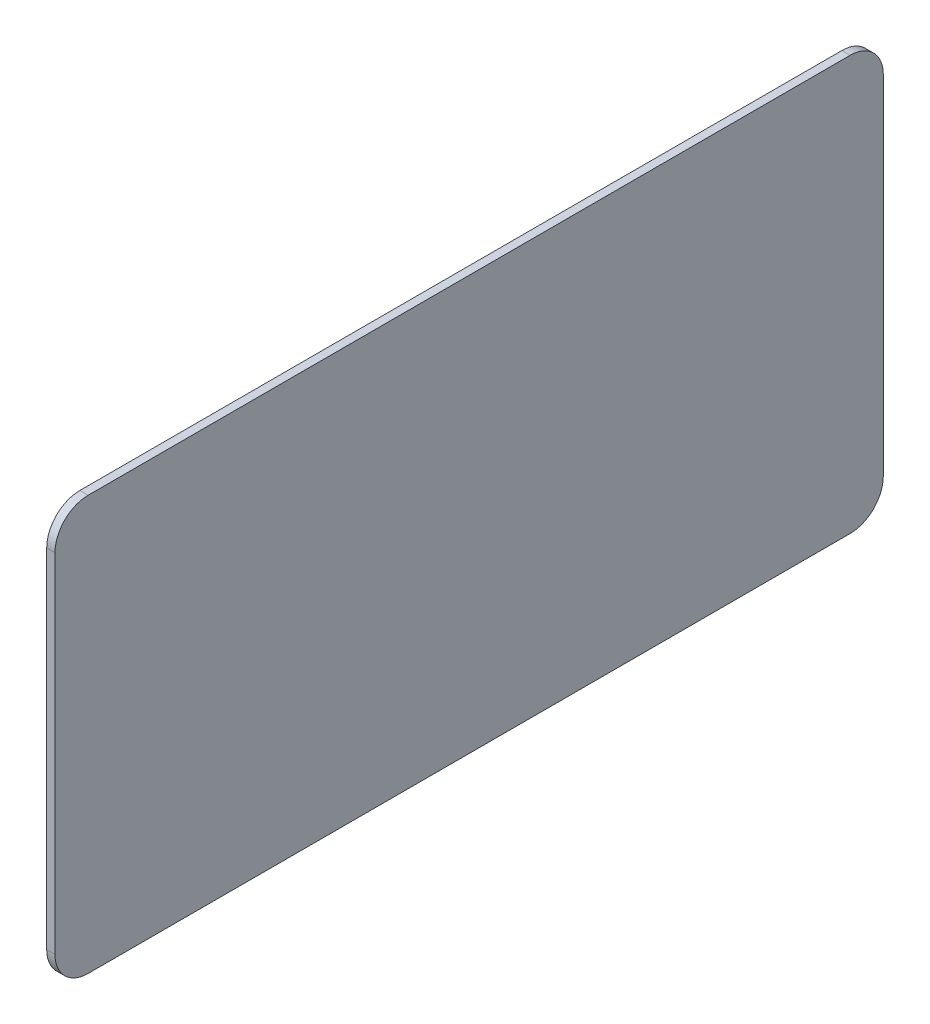
ISO-10303-21;
HEADER;
FILE_DESCRIPTION(('STEP AP214'),'2;1');
FILE_NAME('part.step','',(''),(''),'','','');
FILE_SCHEMA(('AUTOMOTIVE_DESIGN { 1 0 10303 214 1 1 1 1 }'));
ENDSEC;
DATA;
#1=APPLICATION_CONTEXT('core data for automotive mechanical design processes');
#2=APPLICATION_PROTOCOL_DEFINITION('international standard','automotive_design',2000,#1);
#3=PRODUCT_CONTEXT('',#1,'mechanical');
#4=PRODUCT('Part','Part','',(#3));
#5=PRODUCT_RELATED_PRODUCT_CATEGORY('part','',(#4));
#6=PRODUCT_DEFINITION_FORMATION('','',#4);
#7=PRODUCT_DEFINITION_CONTEXT('part definition',#1,'design');
#8=PRODUCT_DEFINITION('design','',#6,#7);
#9=PRODUCT_DEFINITION_SHAPE('','',#8);
#10=(LENGTH_UNIT() NAMED_UNIT(*) SI_UNIT(.MILLI.,.METRE.));
#11=(NAMED_UNIT(*) PLANE_ANGLE_UNIT() SI_UNIT($,.RADIAN.));
#12=(NAMED_UNIT(*) SI_UNIT($,.STERADIAN.) SOLID_ANGLE_UNIT());
#13=UNCERTAINTY_MEASURE_WITH_UNIT(LENGTH_MEASURE(1.E-05),#10,'distance_accuracy_value','');
#14=(GEOMETRIC_REPRESENTATION_CONTEXT(3) GLOBAL_UNCERTAINTY_ASSIGNED_CONTEXT((#13)) GLOBAL_UNIT_ASSIGNED_CONTEXT((#10,
#11,#12)) REPRESENTATION_CONTEXT('',''));
#15=CARTESIAN_POINT('',(0.,0.,0.));
#16=DIRECTION('',(0.,0.,1.));
#17=DIRECTION('',(1.,0.,0.));
#18=AXIS2_PLACEMENT_3D('',#15,#16,#17);
#19=CARTESIAN_POINT('',(15.001,-114.964876976092,25.));
#20=DIRECTION('',(0.,0.,1.));
#21=DIRECTION('',(0.,1.,0.));
#22=AXIS2_PLACEMENT_3D('',#19,#20,#21);
#23=PLANE('',#22);
#24=DIRECTION('',(0.,1.,0.));
#25=VECTOR('',#24,1.);
#26=CARTESIAN_POINT('',(14.5,-104.463876976092,25.));
#27=LINE('',#26,#25);
#28=CARTESIAN_POINT('',(14.5,-114.963876976092,25.));
#29=VERTEX_POINT('',#28);
#30=CARTESIAN_POINT('',(14.5,-93.963876976092,25.));
#31=VERTEX_POINT('',#30);
#32=EDGE_CURVE('E134',#29,#31,#27,.T.);
#33=ORIENTED_EDGE('',*,*,#32,.F.);
#34=DIRECTION('',(-1.,0.,0.));
#35=VECTOR('',#34,1.);
#36=CARTESIAN_POINT('',(14.75,-114.963876976092,25.));
#37=LINE('',#36,#35);
#38=CARTESIAN_POINT('',(15.,-114.963876976092,25.));
#39=VERTEX_POINT('',#38);
#40=EDGE_CURVE('E126',#39,#29,#37,.T.);
#41=ORIENTED_EDGE('',*,*,#40,.F.);
#42=DIRECTION('',(0.,-1.,0.));
#43=VECTOR('',#42,1.);
#44=CARTESIAN_POINT('',(15.,-104.463876976092,25.));
#45=LINE('',#44,#43);
#46=CARTESIAN_POINT('',(15.,-93.963876976092,25.));
#47=VERTEX_POINT('',#46);
#48=EDGE_CURVE('E109',#47,#39,#45,.T.);
#49=ORIENTED_EDGE('',*,*,#48,.F.);
#50=DIRECTION('',(1.,0.,0.));
#51=VECTOR('',#50,1.);
#52=CARTESIAN_POINT('',(14.75,-93.963876976092,25.));
#53=LINE('',#52,#51);
#54=EDGE_CURVE('E102',#31,#47,#53,.T.);
#55=ORIENTED_EDGE('',*,*,#54,.F.);
#56=EDGE_LOOP('',(#33,#41,#49,#55));
#57=FACE_BOUND('',#56,.T.);
#58=ADVANCED_FACE('F17',(#57),#23,.T.);
#59=CARTESIAN_POINT('',(14.5,-93.963876976092,23.));
#60=DIRECTION('',(1.,0.,0.));
#61=DIRECTION('',(0.,0.,-1.));
#62=AXIS2_PLACEMENT_3D('',#59,#60,#61);
#63=CYLINDRICAL_SURFACE('',#62,1.99999999999999);
#64=CARTESIAN_POINT('',(14.5,-93.963876976092,23.));
#65=DIRECTION('',(-1.,0.,0.));
#66=DIRECTION('',(0.,0.,1.));
#67=AXIS2_PLACEMENT_3D('',#64,#65,#66);
#68=CIRCLE('',#67,1.99999999999999);
#69=CARTESIAN_POINT('',(14.5,-91.963876976092,23.));
#70=VERTEX_POINT('',#69);
#71=EDGE_CURVE('E135',#31,#70,#68,.T.);
#72=ORIENTED_EDGE('',*,*,#71,.F.);
#73=ORIENTED_EDGE('',*,*,#54,.T.);
#74=CARTESIAN_POINT('',(15.,-93.963876976092,23.));
#75=DIRECTION('',(1.,0.,0.));
#76=DIRECTION('',(0.,0.,-1.));
#77=AXIS2_PLACEMENT_3D('',#74,#75,#76);
#78=CIRCLE('',#77,1.99999999999999);
#79=CARTESIAN_POINT('',(15.,-91.963876976092,23.));
#80=VERTEX_POINT('',#79);
#81=EDGE_CURVE('E105',#80,#47,#78,.T.);
#82=ORIENTED_EDGE('',*,*,#81,.F.);
#83=DIRECTION('',(1.,0.,0.));
#84=VECTOR('',#83,1.);
#85=CARTESIAN_POINT('',(14.75,-91.963876976092,23.));
#86=LINE('',#85,#84);
#87=EDGE_CURVE('E91',#70,#80,#86,.T.);
#88=ORIENTED_EDGE('',*,*,#87,.F.);
#89=EDGE_LOOP('',(#72,#73,#82,#88));
#90=FACE_BOUND('',#89,.T.);
#91=ADVANCED_FACE('F106',(#90),#63,.T.);
#92=CARTESIAN_POINT('',(15.001,-91.963876976092,23.001));
#93=DIRECTION('',(0.,1.,0.));
#94=DIRECTION('',(0.,0.,-1.));
#95=AXIS2_PLACEMENT_3D('',#92,#93,#94);
#96=PLANE('',#95);
#97=DIRECTION('',(0.,0.,-1.));
#98=VECTOR('',#97,1.);
#99=CARTESIAN_POINT('',(14.5,-91.963876976092,0.));
#100=LINE('',#99,#98);
#101=CARTESIAN_POINT('',(14.5,-91.963876976092,-23.));
#102=VERTEX_POINT('',#101);
#103=EDGE_CURVE('E98',#70,#102,#100,.T.);
#104=ORIENTED_EDGE('',*,*,#103,.F.);
#105=ORIENTED_EDGE('',*,*,#87,.T.);
#106=DIRECTION('',(0.,0.,1.));
#107=VECTOR('',#106,1.);
#108=CARTESIAN_POINT('',(15.,-91.963876976092,0.));
#109=LINE('',#108,#107);
#110=CARTESIAN_POINT('',(15.,-91.963876976092,-23.));
#111=VERTEX_POINT('',#110);
#112=EDGE_CURVE('E95',#111,#80,#109,.T.);
#113=ORIENTED_EDGE('',*,*,#112,.F.);
#114=DIRECTION('',(1.,0.,0.));
#115=VECTOR('',#114,1.);
#116=CARTESIAN_POINT('',(14.75,-91.963876976092,-23.));
#117=LINE('',#116,#115);
#118=EDGE_CURVE('E67',#102,#111,#117,.T.);
#119=ORIENTED_EDGE('',*,*,#118,.F.);
#120=EDGE_LOOP('',(#104,#105,#113,#119));
#121=FACE_BOUND('',#120,.T.);
#122=ADVANCED_FACE('F93',(#121),#96,.T.);
#123=CARTESIAN_POINT('',(14.5,-93.963876976092,-23.));
#124=DIRECTION('',(1.,0.,0.));
#125=DIRECTION('',(0.,0.,-1.));
#126=AXIS2_PLACEMENT_3D('',#123,#124,#125);
#127=CYLINDRICAL_SURFACE('',#126,1.99999999999999);
#128=CARTESIAN_POINT('',(14.5,-93.963876976092,-23.));
#129=DIRECTION('',(-1.,0.,0.));
#130=DIRECTION('',(0.,0.,1.));
#131=AXIS2_PLACEMENT_3D('',#128,#129,#130);
#132=CIRCLE('',#131,1.99999999999999);
#133=CARTESIAN_POINT('',(14.5,-93.963876976092,-25.));
#134=VERTEX_POINT('',#133);
#135=EDGE_CURVE('E137',#102,#134,#132,.T.);
#136=ORIENTED_EDGE('',*,*,#135,.F.);
#137=ORIENTED_EDGE('',*,*,#118,.T.);
#138=CARTESIAN_POINT('',(15.,-93.963876976092,-23.));
#139=DIRECTION('',(1.,0.,0.));
#140=DIRECTION('',(0.,0.,-1.));
#141=AXIS2_PLACEMENT_3D('',#138,#139,#140);
#142=CIRCLE('',#141,1.99999999999999);
#143=CARTESIAN_POINT('',(15.,-93.963876976092,-25.));
#144=VERTEX_POINT('',#143);
#145=EDGE_CURVE('E112',#144,#111,#142,.T.);
#146=ORIENTED_EDGE('',*,*,#145,.F.);
#147=DIRECTION('',(1.,0.,0.));
#148=VECTOR('',#147,1.);
#149=CARTESIAN_POINT('',(14.75,-93.963876976092,-25.));
#150=LINE('',#149,#148);
#151=EDGE_CURVE('E59',#134,#144,#150,.T.);
#152=ORIENTED_EDGE('',*,*,#151,.F.);
#153=EDGE_LOOP('',(#136,#137,#146,#152));
#154=FACE_BOUND('',#153,.T.);
#155=ADVANCED_FACE('F213',(#154),#127,.T.);
#156=CARTESIAN_POINT('',(15.001,-93.962876976092,-25.));
#157=DIRECTION('',(0.,0.,-1.));
#158=DIRECTION('',(0.,-1.,0.));
#159=AXIS2_PLACEMENT_3D('',#156,#157,#158);
#160=PLANE('',#159);
#161=DIRECTION('',(0.,-1.,0.));
#162=VECTOR('',#161,1.);
#163=CARTESIAN_POINT('',(14.5,-104.463876976092,-25.));
#164=LINE('',#163,#162);
#165=CARTESIAN_POINT('',(14.5,-114.963876976092,-25.));
#166=VERTEX_POINT('',#165);
#167=EDGE_CURVE('E139',#134,#166,#164,.T.);
#168=ORIENTED_EDGE('',*,*,#167,.F.);
#169=ORIENTED_EDGE('',*,*,#151,.T.);
#170=DIRECTION('',(0.,1.,0.));
#171=VECTOR('',#170,1.);
#172=CARTESIAN_POINT('',(15.,-104.463876976092,-25.));
#173=LINE('',#172,#171);
#174=CARTESIAN_POINT('',(15.,-114.963876976092,-25.));
#175=VERTEX_POINT('',#174);
#176=EDGE_CURVE('E52',#175,#144,#173,.T.);
#177=ORIENTED_EDGE('',*,*,#176,.F.);
#178=DIRECTION('',(1.,0.,0.));
#179=VECTOR('',#178,1.);
#180=CARTESIAN_POINT('',(14.75,-114.963876976092,-25.));
#181=LINE('',#180,#179);
#182=EDGE_CURVE('E119',#166,#175,#181,.T.);
#183=ORIENTED_EDGE('',*,*,#182,.F.);
#184=EDGE_LOOP('',(#168,#169,#177,#183));
#185=FACE_BOUND('',#184,.T.);
#186=ADVANCED_FACE('F203',(#185),#160,.T.);
#187=CARTESIAN_POINT('',(15.,-91.962876976092,25.001));
#188=DIRECTION('',(1.,0.,0.));
#189=DIRECTION('',(0.,-1.,0.));
#190=AXIS2_PLACEMENT_3D('',#187,#188,#189);
#191=PLANE('',#190);
#192=ORIENTED_EDGE('',*,*,#81,.T.);
#193=ORIENTED_EDGE('',*,*,#48,.T.);
#194=CARTESIAN_POINT('',(15.,-114.963876976092,23.));
#195=DIRECTION('',(1.,0.,0.));
#196=DIRECTION('',(0.,0.,-1.));
#197=AXIS2_PLACEMENT_3D('',#194,#195,#196);
#198=CIRCLE('',#197,2.);
#199=CARTESIAN_POINT('',(15.,-116.963876976092,23.));
#200=VERTEX_POINT('',#199);
#201=EDGE_CURVE('E128',#200,#39,#198,.F.);
#202=ORIENTED_EDGE('',*,*,#201,.F.);
#203=DIRECTION('',(0.,0.,1.));
#204=VECTOR('',#203,1.);
#205=CARTESIAN_POINT('',(15.,-116.963876976092,0.));
#206=LINE('',#205,#204);
#207=CARTESIAN_POINT('',(15.,-116.963876976092,-23.));
#208=VERTEX_POINT('',#207);
#209=EDGE_CURVE('E122',#208,#200,#206,.T.);
#210=ORIENTED_EDGE('',*,*,#209,.F.);
#211=CARTESIAN_POINT('',(15.,-114.963876976092,-23.));
#212=DIRECTION('',(1.,0.,0.));
#213=DIRECTION('',(0.,0.,-1.));
#214=AXIS2_PLACEMENT_3D('',#211,#212,#213);
#215=CIRCLE('',#214,2.);
#216=EDGE_CURVE('E21',#175,#208,#215,.F.);
#217=ORIENTED_EDGE('',*,*,#216,.F.);
#218=ORIENTED_EDGE('',*,*,#176,.T.);
#219=ORIENTED_EDGE('',*,*,#145,.T.);
#220=ORIENTED_EDGE('',*,*,#112,.T.);
#221=EDGE_LOOP('',(#192,#193,#202,#210,#217,#218,#219,#220));
#222=FACE_BOUND('',#221,.T.);
#223=ADVANCED_FACE('F111',(#222),#191,.T.);
#224=CARTESIAN_POINT('',(14.5,-114.963876976092,23.));
#225=DIRECTION('',(1.,0.,0.));
#226=DIRECTION('',(0.,0.,-1.));
#227=AXIS2_PLACEMENT_3D('',#224,#225,#226);
#228=CYLINDRICAL_SURFACE('',#227,2.);
#229=CARTESIAN_POINT('',(14.5,-114.963876976092,23.));
#230=DIRECTION('',(-1.,0.,0.));
#231=DIRECTION('',(0.,0.,1.));
#232=AXIS2_PLACEMENT_3D('',#229,#230,#231);
#233=CIRCLE('',#232,2.);
#234=CARTESIAN_POINT('',(14.5,-116.963876976092,23.));
#235=VERTEX_POINT('',#234);
#236=EDGE_CURVE('E127',#235,#29,#233,.T.);
#237=ORIENTED_EDGE('',*,*,#236,.F.);
#238=DIRECTION('',(-1.,0.,0.));
#239=VECTOR('',#238,1.);
#240=CARTESIAN_POINT('',(14.75,-116.963876976092,23.));
#241=LINE('',#240,#239);
#242=EDGE_CURVE('E147',#200,#235,#241,.T.);
#243=ORIENTED_EDGE('',*,*,#242,.F.);
#244=ORIENTED_EDGE('',*,*,#201,.T.);
#245=ORIENTED_EDGE('',*,*,#40,.T.);
#246=EDGE_LOOP('',(#237,#243,#244,#245));
#247=FACE_BOUND('',#246,.T.);
#248=ADVANCED_FACE('F157',(#247),#228,.T.);
#249=CARTESIAN_POINT('',(14.5,-116.964876976092,25.001));
#250=DIRECTION('',(-1.,0.,0.));
#251=DIRECTION('',(0.,1.,0.));
#252=AXIS2_PLACEMENT_3D('',#249,#250,#251);
#253=PLANE('',#252);
#254=CARTESIAN_POINT('',(14.5,-114.963876976092,-23.));
#255=DIRECTION('',(-1.,0.,0.));
#256=DIRECTION('',(0.,0.,1.));
#257=AXIS2_PLACEMENT_3D('',#254,#255,#256);
#258=CIRCLE('',#257,2.);
#259=CARTESIAN_POINT('',(14.5,-116.963876976092,-23.));
#260=VERTEX_POINT('',#259);
#261=EDGE_CURVE('E36',#260,#166,#258,.F.);
#262=ORIENTED_EDGE('',*,*,#261,.F.);
#263=DIRECTION('',(0.,0.,-1.));
#264=VECTOR('',#263,1.);
#265=CARTESIAN_POINT('',(14.5,-116.963876976092,0.));
#266=LINE('',#265,#264);
#267=EDGE_CURVE('E27',#235,#260,#266,.T.);
#268=ORIENTED_EDGE('',*,*,#267,.F.);
#269=ORIENTED_EDGE('',*,*,#236,.T.);
#270=ORIENTED_EDGE('',*,*,#32,.T.);
#271=ORIENTED_EDGE('',*,*,#71,.T.);
#272=ORIENTED_EDGE('',*,*,#103,.T.);
#273=ORIENTED_EDGE('',*,*,#135,.T.);
#274=ORIENTED_EDGE('',*,*,#167,.T.);
#275=EDGE_LOOP('',(#262,#268,#269,#270,#271,#272,#273,#274));
#276=FACE_BOUND('',#275,.T.);
#277=ADVANCED_FACE('F159',(#276),#253,.T.);
#278=CARTESIAN_POINT('',(14.5,-114.963876976092,-23.));
#279=DIRECTION('',(1.,0.,0.));
#280=DIRECTION('',(0.,0.,-1.));
#281=AXIS2_PLACEMENT_3D('',#278,#279,#280);
#282=CYLINDRICAL_SURFACE('',#281,2.);
#283=ORIENTED_EDGE('',*,*,#261,.T.);
#284=ORIENTED_EDGE('',*,*,#182,.T.);
#285=ORIENTED_EDGE('',*,*,#216,.T.);
#286=DIRECTION('',(1.,0.,0.));
#287=VECTOR('',#286,1.);
#288=CARTESIAN_POINT('',(14.75,-116.963876976092,-23.));
#289=LINE('',#288,#287);
#290=EDGE_CURVE('E11',#260,#208,#289,.T.);
#291=ORIENTED_EDGE('',*,*,#290,.F.);
#292=EDGE_LOOP('',(#283,#284,#285,#291));
#293=FACE_BOUND('',#292,.T.);
#294=ADVANCED_FACE('F161',(#293),#282,.T.);
#295=CARTESIAN_POINT('',(15.001,-116.963876976092,-23.001));
#296=DIRECTION('',(0.,-1.,0.));
#297=DIRECTION('',(0.,0.,1.));
#298=AXIS2_PLACEMENT_3D('',#295,#296,#297);
#299=PLANE('',#298);
#300=ORIENTED_EDGE('',*,*,#267,.T.);
#301=ORIENTED_EDGE('',*,*,#290,.T.);
#302=ORIENTED_EDGE('',*,*,#209,.T.);
#303=ORIENTED_EDGE('',*,*,#242,.T.);
#304=EDGE_LOOP('',(#300,#301,#302,#303));
#305=FACE_BOUND('',#304,.T.);
#306=ADVANCED_FACE('F19',(#305),#299,.T.);
#307=CLOSED_SHELL('',(#58,#91,#122,#155,#186,#223,#248,#277,#294,#306));
#308=MANIFOLD_SOLID_BREP('B1',#307);
#309=ADVANCED_BREP_SHAPE_REPRESENTATION('',(#18,#308),#14);
#310=SHAPE_DEFINITION_REPRESENTATION(#9,#309);
ENDSEC;
END-ISO-10303-21;
